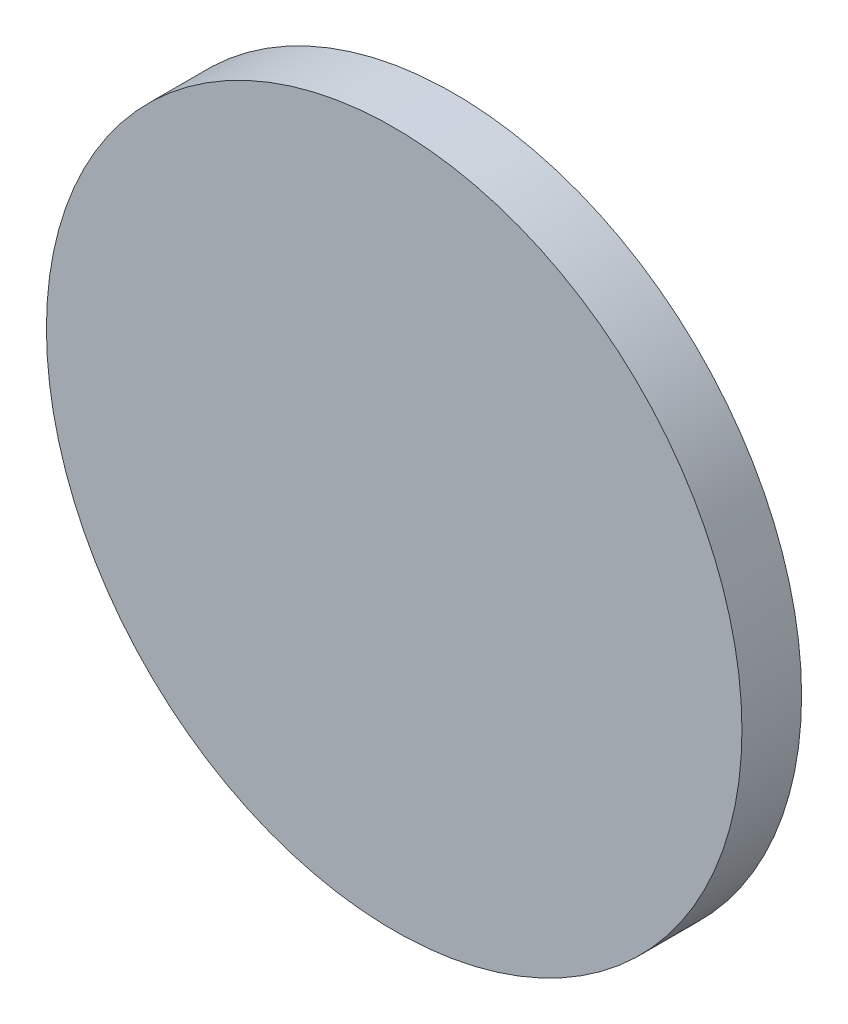
ISO-10303-21;
HEADER;
FILE_DESCRIPTION(('STEP AP214'),'2;1');
FILE_NAME('part.step','',(''),(''),'','','');
FILE_SCHEMA(('AUTOMOTIVE_DESIGN { 1 0 10303 214 1 1 1 1 }'));
ENDSEC;
DATA;
#1=APPLICATION_CONTEXT('core data for automotive mechanical design processes');
#2=APPLICATION_PROTOCOL_DEFINITION('international standard','automotive_design',2000,#1);
#3=PRODUCT_CONTEXT('',#1,'mechanical');
#4=PRODUCT('Part','Part','',(#3));
#5=PRODUCT_RELATED_PRODUCT_CATEGORY('part','',(#4));
#6=PRODUCT_DEFINITION_FORMATION('','',#4);
#7=PRODUCT_DEFINITION_CONTEXT('part definition',#1,'design');
#8=PRODUCT_DEFINITION('design','',#6,#7);
#9=PRODUCT_DEFINITION_SHAPE('','',#8);
#10=(LENGTH_UNIT() NAMED_UNIT(*) SI_UNIT(.MILLI.,.METRE.));
#11=(NAMED_UNIT(*) PLANE_ANGLE_UNIT() SI_UNIT($,.RADIAN.));
#12=(NAMED_UNIT(*) SI_UNIT($,.STERADIAN.) SOLID_ANGLE_UNIT());
#13=UNCERTAINTY_MEASURE_WITH_UNIT(LENGTH_MEASURE(1.E-05),#10,'distance_accuracy_value','');
#14=(GEOMETRIC_REPRESENTATION_CONTEXT(3) GLOBAL_UNCERTAINTY_ASSIGNED_CONTEXT((#13)) GLOBAL_UNIT_ASSIGNED_CONTEXT((#10,
#11,#12)) REPRESENTATION_CONTEXT('',''));
#15=CARTESIAN_POINT('',(0.,0.,0.));
#16=DIRECTION('',(0.,0.,1.));
#17=DIRECTION('',(1.,0.,0.));
#18=AXIS2_PLACEMENT_3D('',#15,#16,#17);
#19=CARTESIAN_POINT('',(2.54508,8.859520006176,0.76487));
#20=DIRECTION('',(0.,0.,-1.));
#21=DIRECTION('',(-1.,0.,0.));
#22=AXIS2_PLACEMENT_3D('',#19,#20,#21);
#23=PLANE('',#22);
#24=CARTESIAN_POINT('',(2.54508,8.859520006176,0.76487));
#25=DIRECTION('',(0.,0.,1.));
#26=DIRECTION('',(1.,0.,0.));
#27=AXIS2_PLACEMENT_3D('',#24,#25,#26);
#28=CIRCLE('',#27,0.200024667);
#29=CARTESIAN_POINT('',(2.745104667,8.859520006176,0.76487));
#30=VERTEX_POINT('',#29);
#31=EDGE_CURVE('E18',#30,#30,#28,.T.);
#32=ORIENTED_EDGE('',*,*,#31,.F.);
#33=EDGE_LOOP('',(#32));
#34=FACE_BOUND('',#33,.T.);
#35=ADVANCED_FACE('F15',(#34),#23,.T.);
#36=CARTESIAN_POINT('',(2.54508,8.859520006176,0.76487));
#37=DIRECTION('',(0.,0.,1.));
#38=DIRECTION('',(1.,0.,0.));
#39=AXIS2_PLACEMENT_3D('',#36,#37,#38);
#40=CYLINDRICAL_SURFACE('',#39,0.200024667);
#41=CARTESIAN_POINT('',(2.54508,8.859520006176,0.79916));
#42=DIRECTION('',(0.,0.,1.));
#43=DIRECTION('',(1.,0.,0.));
#44=AXIS2_PLACEMENT_3D('',#41,#42,#43);
#45=CIRCLE('',#44,0.200024667);
#46=CARTESIAN_POINT('',(2.745104667,8.859520006176,0.79916));
#47=VERTEX_POINT('',#46);
#48=EDGE_CURVE('E10',#47,#47,#45,.T.);
#49=ORIENTED_EDGE('',*,*,#48,.F.);
#50=EDGE_LOOP('',(#49));
#51=FACE_BOUND('',#50,.T.);
#52=ORIENTED_EDGE('',*,*,#31,.T.);
#53=EDGE_LOOP('',(#52));
#54=FACE_BOUND('',#53,.T.);
#55=ADVANCED_FACE('F27',(#51,#54),#40,.T.);
#56=CARTESIAN_POINT('',(2.54508,8.859520006176,0.79916));
#57=DIRECTION('',(0.,0.,1.));
#58=DIRECTION('',(1.,0.,0.));
#59=AXIS2_PLACEMENT_3D('',#56,#57,#58);
#60=PLANE('',#59);
#61=ORIENTED_EDGE('',*,*,#48,.T.);
#62=EDGE_LOOP('',(#61));
#63=FACE_BOUND('',#62,.T.);
#64=ADVANCED_FACE('F34',(#63),#60,.T.);
#65=CLOSED_SHELL('',(#35,#55,#64));
#66=MANIFOLD_SOLID_BREP('B1',#65);
#67=ADVANCED_BREP_SHAPE_REPRESENTATION('',(#18,#66),#14);
#68=SHAPE_DEFINITION_REPRESENTATION(#9,#67);
ENDSEC;
END-ISO-10303-21;
